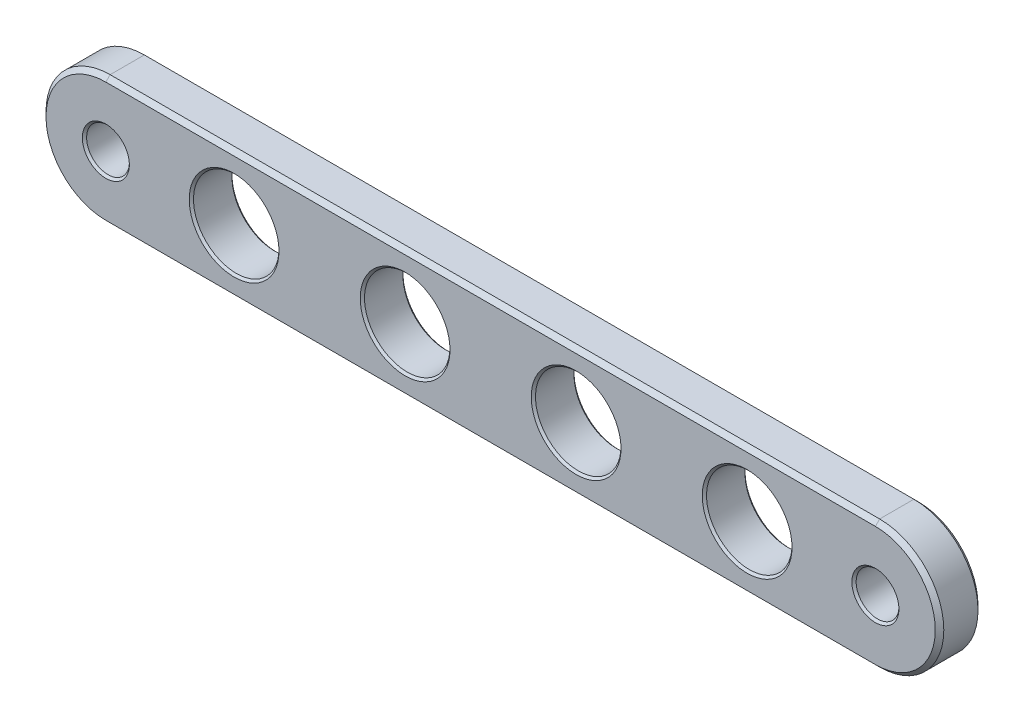
ISO-10303-21;
HEADER;
FILE_DESCRIPTION(('STEP AP214'),'2;1');
FILE_NAME('part.step','',(''),(''),'','','');
FILE_SCHEMA(('AUTOMOTIVE_DESIGN { 1 0 10303 214 1 1 1 1 }'));
ENDSEC;
DATA;
#1=APPLICATION_CONTEXT('core data for automotive mechanical design processes');
#2=APPLICATION_PROTOCOL_DEFINITION('international standard','automotive_design',2000,#1);
#3=PRODUCT_CONTEXT('',#1,'mechanical');
#4=PRODUCT('Part','Part','',(#3));
#5=PRODUCT_RELATED_PRODUCT_CATEGORY('part','',(#4));
#6=PRODUCT_DEFINITION_FORMATION('','',#4);
#7=PRODUCT_DEFINITION_CONTEXT('part definition',#1,'design');
#8=PRODUCT_DEFINITION('design','',#6,#7);
#9=PRODUCT_DEFINITION_SHAPE('','',#8);
#10=(LENGTH_UNIT() NAMED_UNIT(*) SI_UNIT(.MILLI.,.METRE.));
#11=(NAMED_UNIT(*) PLANE_ANGLE_UNIT() SI_UNIT($,.RADIAN.));
#12=(NAMED_UNIT(*) SI_UNIT($,.STERADIAN.) SOLID_ANGLE_UNIT());
#13=UNCERTAINTY_MEASURE_WITH_UNIT(LENGTH_MEASURE(1.E-05),#10,'distance_accuracy_value','');
#14=(GEOMETRIC_REPRESENTATION_CONTEXT(3) GLOBAL_UNCERTAINTY_ASSIGNED_CONTEXT((#13)) GLOBAL_UNIT_ASSIGNED_CONTEXT((#10,
#11,#12)) REPRESENTATION_CONTEXT('',''));
#15=CARTESIAN_POINT('',(0.,0.,0.));
#16=DIRECTION('',(0.,0.,1.));
#17=DIRECTION('',(1.,0.,0.));
#18=AXIS2_PLACEMENT_3D('',#15,#16,#17);
#19=CARTESIAN_POINT('',(-18.,0.,2.));
#20=DIRECTION('',(0.,0.,-1.));
#21=DIRECTION('',(-1.,0.,0.));
#22=AXIS2_PLACEMENT_3D('',#19,#20,#21);
#23=CYLINDRICAL_SURFACE('',#22,3.);
#24=DIRECTION('',(0.,0.,-1.));
#25=VECTOR('',#24,1.);
#26=CARTESIAN_POINT('',(-18.,3.,2.));
#27=LINE('',#26,#25);
#28=CARTESIAN_POINT('',(-18.,3.,1.8));
#29=VERTEX_POINT('',#28);
#30=CARTESIAN_POINT('',(-18.,3.,0.199999999999999));
#31=VERTEX_POINT('',#30);
#32=EDGE_CURVE('E133',#29,#31,#27,.T.);
#33=ORIENTED_EDGE('',*,*,#32,.T.);
#34=CARTESIAN_POINT('',(-18.,0.,0.199999999999999));
#35=DIRECTION('',(0.,0.,1.));
#36=DIRECTION('',(1.,0.,0.));
#37=AXIS2_PLACEMENT_3D('',#34,#35,#36);
#38=CIRCLE('',#37,3.);
#39=CARTESIAN_POINT('',(-18.,-3.,0.199999999999999));
#40=VERTEX_POINT('',#39);
#41=EDGE_CURVE('E140',#31,#40,#38,.T.);
#42=ORIENTED_EDGE('',*,*,#41,.T.);
#43=DIRECTION('',(0.,0.,-1.));
#44=VECTOR('',#43,1.);
#45=CARTESIAN_POINT('',(-18.,-3.,2.));
#46=LINE('',#45,#44);
#47=CARTESIAN_POINT('',(-18.,-3.,1.8));
#48=VERTEX_POINT('',#47);
#49=EDGE_CURVE('E135',#48,#40,#46,.T.);
#50=ORIENTED_EDGE('',*,*,#49,.F.);
#51=CARTESIAN_POINT('',(-18.,0.,1.8));
#52=DIRECTION('',(0.,0.,1.));
#53=DIRECTION('',(1.,0.,0.));
#54=AXIS2_PLACEMENT_3D('',#51,#52,#53);
#55=CIRCLE('',#54,3.);
#56=EDGE_CURVE('E131',#48,#29,#55,.F.);
#57=ORIENTED_EDGE('',*,*,#56,.T.);
#58=EDGE_LOOP('',(#33,#42,#50,#57));
#59=FACE_BOUND('',#58,.T.);
#60=ADVANCED_FACE('F60',(#59),#23,.T.);
#61=CARTESIAN_POINT('',(-18.,-3.,2.));
#62=DIRECTION('',(0.,1.,0.));
#63=DIRECTION('',(-1.,0.,0.));
#64=AXIS2_PLACEMENT_3D('',#61,#62,#63);
#65=PLANE('',#64);
#66=ORIENTED_EDGE('',*,*,#49,.T.);
#67=DIRECTION('',(1.,0.,0.));
#68=VECTOR('',#67,1.);
#69=CARTESIAN_POINT('',(-18.,-3.,0.199999999999999));
#70=LINE('',#69,#68);
#71=CARTESIAN_POINT('',(18.,-2.99999999999999,0.199999999999999));
#72=VERTEX_POINT('',#71);
#73=EDGE_CURVE('E332',#40,#72,#70,.T.);
#74=ORIENTED_EDGE('',*,*,#73,.T.);
#75=DIRECTION('',(0.,0.,-1.));
#76=VECTOR('',#75,1.);
#77=CARTESIAN_POINT('',(18.,-2.99999999999999,2.));
#78=LINE('',#77,#76);
#79=CARTESIAN_POINT('',(18.,-2.99999999999999,1.8));
#80=VERTEX_POINT('',#79);
#81=EDGE_CURVE('E861',#80,#72,#78,.T.);
#82=ORIENTED_EDGE('',*,*,#81,.F.);
#83=DIRECTION('',(-1.,0.,0.));
#84=VECTOR('',#83,1.);
#85=CARTESIAN_POINT('',(-18.,-3.,1.8));
#86=LINE('',#85,#84);
#87=EDGE_CURVE('E348',#80,#48,#86,.T.);
#88=ORIENTED_EDGE('',*,*,#87,.T.);
#89=EDGE_LOOP('',(#66,#74,#82,#88));
#90=FACE_BOUND('',#89,.T.);
#91=ADVANCED_FACE('F373',(#90),#65,.F.);
#92=CARTESIAN_POINT('',(18.,0.,2.));
#93=DIRECTION('',(0.,0.,-1.));
#94=DIRECTION('',(-1.,0.,0.));
#95=AXIS2_PLACEMENT_3D('',#92,#93,#94);
#96=CYLINDRICAL_SURFACE('',#95,3.);
#97=ORIENTED_EDGE('',*,*,#81,.T.);
#98=CARTESIAN_POINT('',(18.,0.,0.199999999999999));
#99=DIRECTION('',(0.,0.,1.));
#100=DIRECTION('',(1.,0.,0.));
#101=AXIS2_PLACEMENT_3D('',#98,#99,#100);
#102=CIRCLE('',#101,3.);
#103=CARTESIAN_POINT('',(18.,3.00000000000001,0.199999999999999));
#104=VERTEX_POINT('',#103);
#105=EDGE_CURVE('E329',#72,#104,#102,.T.);
#106=ORIENTED_EDGE('',*,*,#105,.T.);
#107=DIRECTION('',(0.,0.,-1.));
#108=VECTOR('',#107,1.);
#109=CARTESIAN_POINT('',(18.,3.00000000000001,2.));
#110=LINE('',#109,#108);
#111=CARTESIAN_POINT('',(18.,3.00000000000001,1.8));
#112=VERTEX_POINT('',#111);
#113=EDGE_CURVE('E153',#112,#104,#110,.T.);
#114=ORIENTED_EDGE('',*,*,#113,.F.);
#115=CARTESIAN_POINT('',(18.,0.,1.8));
#116=DIRECTION('',(0.,0.,1.));
#117=DIRECTION('',(1.,0.,0.));
#118=AXIS2_PLACEMENT_3D('',#115,#116,#117);
#119=CIRCLE('',#118,3.);
#120=EDGE_CURVE('E343',#112,#80,#119,.F.);
#121=ORIENTED_EDGE('',*,*,#120,.T.);
#122=EDGE_LOOP('',(#97,#106,#114,#121));
#123=FACE_BOUND('',#122,.T.);
#124=ADVANCED_FACE('F368',(#123),#96,.T.);
#125=CARTESIAN_POINT('',(-18.,3.,2.));
#126=DIRECTION('',(0.,-1.,0.));
#127=DIRECTION('',(1.,0.,0.));
#128=AXIS2_PLACEMENT_3D('',#125,#126,#127);
#129=PLANE('',#128);
#130=ORIENTED_EDGE('',*,*,#113,.T.);
#131=DIRECTION('',(-1.,0.,0.));
#132=VECTOR('',#131,1.);
#133=CARTESIAN_POINT('',(-18.,3.,0.199999999999999));
#134=LINE('',#133,#132);
#135=EDGE_CURVE('E151',#104,#31,#134,.T.);
#136=ORIENTED_EDGE('',*,*,#135,.T.);
#137=ORIENTED_EDGE('',*,*,#32,.F.);
#138=DIRECTION('',(1.,0.,0.));
#139=VECTOR('',#138,1.);
#140=CARTESIAN_POINT('',(18.,3.00000000000001,1.8));
#141=LINE('',#140,#139);
#142=EDGE_CURVE('E148',#29,#112,#141,.T.);
#143=ORIENTED_EDGE('',*,*,#142,.T.);
#144=EDGE_LOOP('',(#130,#136,#137,#143));
#145=FACE_BOUND('',#144,.T.);
#146=ADVANCED_FACE('F147',(#145),#129,.F.);
#147=CARTESIAN_POINT('',(-18.,0.,2.));
#148=DIRECTION('',(0.,0.,1.));
#149=DIRECTION('',(1.,0.,0.));
#150=AXIS2_PLACEMENT_3D('',#147,#148,#149);
#151=PLANE('',#150);
#152=CARTESIAN_POINT('',(18.,0.,2.));
#153=DIRECTION('',(0.,0.,1.));
#154=DIRECTION('',(1.,0.,0.));
#155=AXIS2_PLACEMENT_3D('',#152,#153,#154);
#156=CIRCLE('',#155,1.1);
#157=CARTESIAN_POINT('',(19.1,0.,2.));
#158=VERTEX_POINT('',#157);
#159=EDGE_CURVE('E204',#158,#158,#156,.F.);
#160=ORIENTED_EDGE('',*,*,#159,.T.);
#161=EDGE_LOOP('',(#160));
#162=FACE_BOUND('',#161,.T.);
#163=CARTESIAN_POINT('',(12.,0.,2.));
#164=DIRECTION('',(0.,0.,1.));
#165=DIRECTION('',(1.,0.,0.));
#166=AXIS2_PLACEMENT_3D('',#163,#164,#165);
#167=CIRCLE('',#166,2.1);
#168=CARTESIAN_POINT('',(14.1,0.,2.));
#169=VERTEX_POINT('',#168);
#170=EDGE_CURVE('E200',#169,#169,#167,.F.);
#171=ORIENTED_EDGE('',*,*,#170,.T.);
#172=EDGE_LOOP('',(#171));
#173=FACE_BOUND('',#172,.T.);
#174=CARTESIAN_POINT('',(4.,0.,2.));
#175=DIRECTION('',(0.,0.,1.));
#176=DIRECTION('',(1.,0.,0.));
#177=AXIS2_PLACEMENT_3D('',#174,#175,#176);
#178=CIRCLE('',#177,2.1);
#179=CARTESIAN_POINT('',(6.1,0.,2.));
#180=VERTEX_POINT('',#179);
#181=EDGE_CURVE('E196',#180,#180,#178,.F.);
#182=ORIENTED_EDGE('',*,*,#181,.T.);
#183=EDGE_LOOP('',(#182));
#184=FACE_BOUND('',#183,.T.);
#185=CARTESIAN_POINT('',(-4.,0.,2.));
#186=DIRECTION('',(0.,0.,1.));
#187=DIRECTION('',(1.,0.,0.));
#188=AXIS2_PLACEMENT_3D('',#185,#186,#187);
#189=CIRCLE('',#188,2.1);
#190=CARTESIAN_POINT('',(-1.89999999999999,0.,2.));
#191=VERTEX_POINT('',#190);
#192=EDGE_CURVE('E192',#191,#191,#189,.F.);
#193=ORIENTED_EDGE('',*,*,#192,.T.);
#194=EDGE_LOOP('',(#193));
#195=FACE_BOUND('',#194,.T.);
#196=CARTESIAN_POINT('',(-12.,0.,2.));
#197=DIRECTION('',(0.,0.,1.));
#198=DIRECTION('',(1.,0.,0.));
#199=AXIS2_PLACEMENT_3D('',#196,#197,#198);
#200=CIRCLE('',#199,2.1);
#201=CARTESIAN_POINT('',(-9.89999999999999,0.,2.));
#202=VERTEX_POINT('',#201);
#203=EDGE_CURVE('E188',#202,#202,#200,.F.);
#204=ORIENTED_EDGE('',*,*,#203,.T.);
#205=EDGE_LOOP('',(#204));
#206=FACE_BOUND('',#205,.T.);
#207=CARTESIAN_POINT('',(-18.,0.,2.));
#208=DIRECTION('',(0.,0.,1.));
#209=DIRECTION('',(1.,0.,0.));
#210=AXIS2_PLACEMENT_3D('',#207,#208,#209);
#211=CIRCLE('',#210,1.1);
#212=CARTESIAN_POINT('',(-16.9,0.,2.));
#213=VERTEX_POINT('',#212);
#214=EDGE_CURVE('E183',#213,#213,#211,.F.);
#215=ORIENTED_EDGE('',*,*,#214,.T.);
#216=EDGE_LOOP('',(#215));
#217=FACE_BOUND('',#216,.T.);
#218=CARTESIAN_POINT('',(18.,0.,2.));
#219=DIRECTION('',(0.,0.,1.));
#220=DIRECTION('',(1.,0.,0.));
#221=AXIS2_PLACEMENT_3D('',#218,#219,#220);
#222=CIRCLE('',#221,2.8);
#223=CARTESIAN_POINT('',(18.,-2.8,2.));
#224=VERTEX_POINT('',#223);
#225=CARTESIAN_POINT('',(18.,2.80000000000001,2.));
#226=VERTEX_POINT('',#225);
#227=EDGE_CURVE('E85',#224,#226,#222,.T.);
#228=ORIENTED_EDGE('',*,*,#227,.T.);
#229=DIRECTION('',(-1.,0.,0.));
#230=VECTOR('',#229,1.);
#231=CARTESIAN_POINT('',(-18.,2.8,2.));
#232=LINE('',#231,#230);
#233=CARTESIAN_POINT('',(-18.,2.8,2.));
#234=VERTEX_POINT('',#233);
#235=EDGE_CURVE('E184',#226,#234,#232,.T.);
#236=ORIENTED_EDGE('',*,*,#235,.T.);
#237=CARTESIAN_POINT('',(-18.,0.,2.));
#238=DIRECTION('',(0.,0.,1.));
#239=DIRECTION('',(1.,0.,0.));
#240=AXIS2_PLACEMENT_3D('',#237,#238,#239);
#241=CIRCLE('',#240,2.8);
#242=CARTESIAN_POINT('',(-18.,-2.8,2.));
#243=VERTEX_POINT('',#242);
#244=EDGE_CURVE('E162',#234,#243,#241,.T.);
#245=ORIENTED_EDGE('',*,*,#244,.T.);
#246=DIRECTION('',(1.,0.,0.));
#247=VECTOR('',#246,1.);
#248=CARTESIAN_POINT('',(18.,-2.8,2.));
#249=LINE('',#248,#247);
#250=EDGE_CURVE('E353',#243,#224,#249,.T.);
#251=ORIENTED_EDGE('',*,*,#250,.T.);
#252=EDGE_LOOP('',(#228,#236,#245,#251));
#253=FACE_BOUND('',#252,.T.);
#254=ADVANCED_FACE('F285',(#162,#173,#184,#195,#206,#217,#253),#151,.T.);
#255=CARTESIAN_POINT('',(-18.,0.,0.));
#256=DIRECTION('',(0.,0.,1.));
#257=DIRECTION('',(1.,0.,0.));
#258=AXIS2_PLACEMENT_3D('',#255,#256,#257);
#259=PLANE('',#258);
#260=CARTESIAN_POINT('',(18.,0.,0.));
#261=DIRECTION('',(0.,0.,1.));
#262=DIRECTION('',(1.,0.,0.));
#263=AXIS2_PLACEMENT_3D('',#260,#261,#262);
#264=CIRCLE('',#263,1.09999999999999);
#265=CARTESIAN_POINT('',(19.1,0.,0.));
#266=VERTEX_POINT('',#265);
#267=EDGE_CURVE('E248',#266,#266,#264,.T.);
#268=ORIENTED_EDGE('',*,*,#267,.T.);
#269=EDGE_LOOP('',(#268));
#270=FACE_BOUND('',#269,.T.);
#271=CARTESIAN_POINT('',(12.,0.,0.));
#272=DIRECTION('',(0.,0.,1.));
#273=DIRECTION('',(1.,0.,0.));
#274=AXIS2_PLACEMENT_3D('',#271,#272,#273);
#275=CIRCLE('',#274,2.1);
#276=CARTESIAN_POINT('',(14.1,0.,0.));
#277=VERTEX_POINT('',#276);
#278=EDGE_CURVE('E244',#277,#277,#275,.T.);
#279=ORIENTED_EDGE('',*,*,#278,.T.);
#280=EDGE_LOOP('',(#279));
#281=FACE_BOUND('',#280,.T.);
#282=CARTESIAN_POINT('',(4.,0.,0.));
#283=DIRECTION('',(0.,0.,1.));
#284=DIRECTION('',(1.,0.,0.));
#285=AXIS2_PLACEMENT_3D('',#282,#283,#284);
#286=CIRCLE('',#285,2.1);
#287=CARTESIAN_POINT('',(6.1,0.,0.));
#288=VERTEX_POINT('',#287);
#289=EDGE_CURVE('E240',#288,#288,#286,.T.);
#290=ORIENTED_EDGE('',*,*,#289,.T.);
#291=EDGE_LOOP('',(#290));
#292=FACE_BOUND('',#291,.T.);
#293=CARTESIAN_POINT('',(-4.,0.,0.));
#294=DIRECTION('',(0.,0.,1.));
#295=DIRECTION('',(1.,0.,0.));
#296=AXIS2_PLACEMENT_3D('',#293,#294,#295);
#297=CIRCLE('',#296,2.1);
#298=CARTESIAN_POINT('',(-1.89999999999999,0.,0.));
#299=VERTEX_POINT('',#298);
#300=EDGE_CURVE('E236',#299,#299,#297,.T.);
#301=ORIENTED_EDGE('',*,*,#300,.T.);
#302=EDGE_LOOP('',(#301));
#303=FACE_BOUND('',#302,.T.);
#304=CARTESIAN_POINT('',(-12.,0.,0.));
#305=DIRECTION('',(0.,0.,1.));
#306=DIRECTION('',(1.,0.,0.));
#307=AXIS2_PLACEMENT_3D('',#304,#305,#306);
#308=CIRCLE('',#307,2.1);
#309=CARTESIAN_POINT('',(-9.89999999999999,0.,0.));
#310=VERTEX_POINT('',#309);
#311=EDGE_CURVE('E232',#310,#310,#308,.T.);
#312=ORIENTED_EDGE('',*,*,#311,.T.);
#313=EDGE_LOOP('',(#312));
#314=FACE_BOUND('',#313,.T.);
#315=CARTESIAN_POINT('',(-18.,0.,0.));
#316=DIRECTION('',(0.,0.,1.));
#317=DIRECTION('',(1.,0.,0.));
#318=AXIS2_PLACEMENT_3D('',#315,#316,#317);
#319=CIRCLE('',#318,1.09999999999999);
#320=CARTESIAN_POINT('',(-16.9,0.,0.));
#321=VERTEX_POINT('',#320);
#322=EDGE_CURVE('E228',#321,#321,#319,.T.);
#323=ORIENTED_EDGE('',*,*,#322,.T.);
#324=EDGE_LOOP('',(#323));
#325=FACE_BOUND('',#324,.T.);
#326=CARTESIAN_POINT('',(-18.,0.,0.));
#327=DIRECTION('',(0.,0.,1.));
#328=DIRECTION('',(1.,0.,0.));
#329=AXIS2_PLACEMENT_3D('',#326,#327,#328);
#330=CIRCLE('',#329,2.8);
#331=CARTESIAN_POINT('',(-18.,-2.8,0.));
#332=VERTEX_POINT('',#331);
#333=CARTESIAN_POINT('',(-18.,2.8,0.));
#334=VERTEX_POINT('',#333);
#335=EDGE_CURVE('E292',#332,#334,#330,.F.);
#336=ORIENTED_EDGE('',*,*,#335,.T.);
#337=DIRECTION('',(1.,0.,0.));
#338=VECTOR('',#337,1.);
#339=CARTESIAN_POINT('',(-18.,2.8,0.));
#340=LINE('',#339,#338);
#341=CARTESIAN_POINT('',(18.,2.8,0.));
#342=VERTEX_POINT('',#341);
#343=EDGE_CURVE('E141',#334,#342,#340,.T.);
#344=ORIENTED_EDGE('',*,*,#343,.T.);
#345=CARTESIAN_POINT('',(18.,0.,0.));
#346=DIRECTION('',(0.,0.,1.));
#347=DIRECTION('',(1.,0.,0.));
#348=AXIS2_PLACEMENT_3D('',#345,#346,#347);
#349=CIRCLE('',#348,2.8);
#350=CARTESIAN_POINT('',(18.,-2.79999999999999,0.));
#351=VERTEX_POINT('',#350);
#352=EDGE_CURVE('E301',#342,#351,#349,.F.);
#353=ORIENTED_EDGE('',*,*,#352,.T.);
#354=DIRECTION('',(-1.,0.,0.));
#355=VECTOR('',#354,1.);
#356=CARTESIAN_POINT('',(-18.,-2.8,0.));
#357=LINE('',#356,#355);
#358=EDGE_CURVE('E295',#351,#332,#357,.T.);
#359=ORIENTED_EDGE('',*,*,#358,.T.);
#360=EDGE_LOOP('',(#336,#344,#353,#359));
#361=FACE_BOUND('',#360,.T.);
#362=ADVANCED_FACE('F281',(#270,#281,#292,#303,#314,#325,#361),#259,.F.);
#363=CARTESIAN_POINT('',(-18.,-3.,0.199999999999999));
#364=DIRECTION('',(0.,0.707106781186541,0.707106781186554));
#365=DIRECTION('',(1.,0.,0.));
#366=AXIS2_PLACEMENT_3D('',#363,#364,#365);
#367=PLANE('',#366);
#368=DIRECTION('',(0.,-0.707106781186554,0.707106781186541));
#369=VECTOR('',#368,1.);
#370=CARTESIAN_POINT('',(-18.,-2.8,0.));
#371=LINE('',#370,#369);
#372=EDGE_CURVE('E316',#332,#40,#371,.T.);
#373=ORIENTED_EDGE('',*,*,#372,.F.);
#374=ORIENTED_EDGE('',*,*,#358,.F.);
#375=DIRECTION('',(0.,0.707106781186554,-0.707106781186541));
#376=VECTOR('',#375,1.);
#377=CARTESIAN_POINT('',(18.,-2.99999999999999,0.199999999999999));
#378=LINE('',#377,#376);
#379=EDGE_CURVE('E154',#72,#351,#378,.T.);
#380=ORIENTED_EDGE('',*,*,#379,.F.);
#381=ORIENTED_EDGE('',*,*,#73,.F.);
#382=EDGE_LOOP('',(#373,#374,#380,#381));
#383=FACE_BOUND('',#382,.T.);
#384=ADVANCED_FACE('F284',(#383),#367,.F.);
#385=CARTESIAN_POINT('',(18.,0.,0.199999999999999));
#386=DIRECTION('',(0.,0.,1.));
#387=DIRECTION('',(1.,0.,0.));
#388=AXIS2_PLACEMENT_3D('',#385,#386,#387);
#389=CONICAL_SURFACE('',#388,3.,0.785398163397457);
#390=ORIENTED_EDGE('',*,*,#379,.T.);
#391=ORIENTED_EDGE('',*,*,#352,.F.);
#392=DIRECTION('',(0.,-0.707106781186554,-0.707106781186541));
#393=VECTOR('',#392,1.);
#394=CARTESIAN_POINT('',(18.,3.00000000000001,0.199999999999999));
#395=LINE('',#394,#393);
#396=EDGE_CURVE('E307',#104,#342,#395,.T.);
#397=ORIENTED_EDGE('',*,*,#396,.F.);
#398=ORIENTED_EDGE('',*,*,#105,.F.);
#399=EDGE_LOOP('',(#390,#391,#397,#398));
#400=FACE_BOUND('',#399,.T.);
#401=ADVANCED_FACE('F328',(#400),#389,.T.);
#402=CARTESIAN_POINT('',(-18.,0.,0.199999999999999));
#403=DIRECTION('',(0.,0.,1.));
#404=DIRECTION('',(1.,0.,0.));
#405=AXIS2_PLACEMENT_3D('',#402,#403,#404);
#406=CONICAL_SURFACE('',#405,3.,0.785398163397457);
#407=ORIENTED_EDGE('',*,*,#372,.T.);
#408=ORIENTED_EDGE('',*,*,#41,.F.);
#409=DIRECTION('',(0.,0.707106781186554,0.707106781186541));
#410=VECTOR('',#409,1.);
#411=CARTESIAN_POINT('',(-18.,2.8,0.));
#412=LINE('',#411,#410);
#413=EDGE_CURVE('E178',#334,#31,#412,.T.);
#414=ORIENTED_EDGE('',*,*,#413,.F.);
#415=ORIENTED_EDGE('',*,*,#335,.F.);
#416=EDGE_LOOP('',(#407,#408,#414,#415));
#417=FACE_BOUND('',#416,.T.);
#418=ADVANCED_FACE('F311',(#417),#406,.T.);
#419=CARTESIAN_POINT('',(-18.,3.,0.199999999999999));
#420=DIRECTION('',(0.,-0.707106781186541,0.707106781186554));
#421=DIRECTION('',(-1.,0.,0.));
#422=AXIS2_PLACEMENT_3D('',#419,#420,#421);
#423=PLANE('',#422);
#424=ORIENTED_EDGE('',*,*,#396,.T.);
#425=ORIENTED_EDGE('',*,*,#343,.F.);
#426=ORIENTED_EDGE('',*,*,#413,.T.);
#427=ORIENTED_EDGE('',*,*,#135,.F.);
#428=EDGE_LOOP('',(#424,#425,#426,#427));
#429=FACE_BOUND('',#428,.T.);
#430=ADVANCED_FACE('F304',(#429),#423,.F.);
#431=CARTESIAN_POINT('',(-18.,-2.8,2.));
#432=DIRECTION('',(0.,-0.707106781186547,0.707106781186547));
#433=DIRECTION('',(-1.,0.,0.));
#434=AXIS2_PLACEMENT_3D('',#431,#432,#433);
#435=PLANE('',#434);
#436=DIRECTION('',(0.,0.707106781186547,0.707106781186547));
#437=VECTOR('',#436,1.);
#438=CARTESIAN_POINT('',(-18.,-3.,1.8));
#439=LINE('',#438,#437);
#440=EDGE_CURVE('E167',#48,#243,#439,.T.);
#441=ORIENTED_EDGE('',*,*,#440,.F.);
#442=ORIENTED_EDGE('',*,*,#87,.F.);
#443=DIRECTION('',(0.,-0.707106781186547,-0.707106781186547));
#444=VECTOR('',#443,1.);
#445=CARTESIAN_POINT('',(18.,-2.8,2.));
#446=LINE('',#445,#444);
#447=EDGE_CURVE('E174',#224,#80,#446,.T.);
#448=ORIENTED_EDGE('',*,*,#447,.F.);
#449=ORIENTED_EDGE('',*,*,#250,.F.);
#450=EDGE_LOOP('',(#441,#442,#448,#449));
#451=FACE_BOUND('',#450,.T.);
#452=ADVANCED_FACE('F389',(#451),#435,.T.);
#453=CARTESIAN_POINT('',(18.,0.,2.));
#454=DIRECTION('',(0.,0.,-1.));
#455=DIRECTION('',(-1.,0.,0.));
#456=AXIS2_PLACEMENT_3D('',#453,#454,#455);
#457=CONICAL_SURFACE('',#456,2.8,0.785398163397448);
#458=ORIENTED_EDGE('',*,*,#447,.T.);
#459=ORIENTED_EDGE('',*,*,#120,.F.);
#460=DIRECTION('',(0.,0.707106781186547,-0.707106781186547));
#461=VECTOR('',#460,1.);
#462=CARTESIAN_POINT('',(18.,2.80000000000001,2.));
#463=LINE('',#462,#461);
#464=EDGE_CURVE('E157',#226,#112,#463,.T.);
#465=ORIENTED_EDGE('',*,*,#464,.F.);
#466=ORIENTED_EDGE('',*,*,#227,.F.);
#467=EDGE_LOOP('',(#458,#459,#465,#466));
#468=FACE_BOUND('',#467,.T.);
#469=ADVANCED_FACE('F417',(#468),#457,.T.);
#470=CARTESIAN_POINT('',(-18.,0.,2.));
#471=DIRECTION('',(0.,0.,-1.));
#472=DIRECTION('',(-1.,0.,0.));
#473=AXIS2_PLACEMENT_3D('',#470,#471,#472);
#474=CONICAL_SURFACE('',#473,2.8,0.785398163397448);
#475=ORIENTED_EDGE('',*,*,#440,.T.);
#476=ORIENTED_EDGE('',*,*,#244,.F.);
#477=DIRECTION('',(0.,-0.707106781186547,0.707106781186547));
#478=VECTOR('',#477,1.);
#479=CARTESIAN_POINT('',(-18.,3.,1.8));
#480=LINE('',#479,#478);
#481=EDGE_CURVE('E77',#29,#234,#480,.T.);
#482=ORIENTED_EDGE('',*,*,#481,.F.);
#483=ORIENTED_EDGE('',*,*,#56,.F.);
#484=EDGE_LOOP('',(#475,#476,#482,#483));
#485=FACE_BOUND('',#484,.T.);
#486=ADVANCED_FACE('F161',(#485),#474,.T.);
#487=CARTESIAN_POINT('',(-18.,2.8,2.));
#488=DIRECTION('',(0.,0.707106781186547,0.707106781186547));
#489=DIRECTION('',(1.,0.,0.));
#490=AXIS2_PLACEMENT_3D('',#487,#488,#489);
#491=PLANE('',#490);
#492=ORIENTED_EDGE('',*,*,#464,.T.);
#493=ORIENTED_EDGE('',*,*,#142,.F.);
#494=ORIENTED_EDGE('',*,*,#481,.T.);
#495=ORIENTED_EDGE('',*,*,#235,.F.);
#496=EDGE_LOOP('',(#492,#493,#494,#495));
#497=FACE_BOUND('',#496,.T.);
#498=ADVANCED_FACE('F156',(#497),#491,.T.);
#499=CARTESIAN_POINT('',(18.,0.,0.));
#500=DIRECTION('',(0.,0.,1.));
#501=DIRECTION('',(1.,0.,0.));
#502=AXIS2_PLACEMENT_3D('',#499,#500,#501);
#503=CYLINDRICAL_SURFACE('',#502,1.);
#504=CARTESIAN_POINT('',(18.,0.,0.0999999999999918));
#505=DIRECTION('',(0.,0.,1.));
#506=DIRECTION('',(1.,0.,0.));
#507=AXIS2_PLACEMENT_3D('',#504,#505,#506);
#508=CIRCLE('',#507,1.);
#509=CARTESIAN_POINT('',(19.,0.,0.0999999999999918));
#510=VERTEX_POINT('',#509);
#511=EDGE_CURVE('E252',#510,#510,#508,.F.);
#512=ORIENTED_EDGE('',*,*,#511,.T.);
#513=EDGE_LOOP('',(#512));
#514=FACE_BOUND('',#513,.T.);
#515=CARTESIAN_POINT('',(18.,0.,1.90000000000001));
#516=DIRECTION('',(0.,0.,1.));
#517=DIRECTION('',(1.,0.,0.));
#518=AXIS2_PLACEMENT_3D('',#515,#516,#517);
#519=CIRCLE('',#518,1.);
#520=CARTESIAN_POINT('',(19.,0.,1.90000000000001));
#521=VERTEX_POINT('',#520);
#522=EDGE_CURVE('E179',#521,#521,#519,.T.);
#523=ORIENTED_EDGE('',*,*,#522,.T.);
#524=EDGE_LOOP('',(#523));
#525=FACE_BOUND('',#524,.T.);
#526=ADVANCED_FACE('F411',(#514,#525),#503,.F.);
#527=CARTESIAN_POINT('',(12.,0.,0.));
#528=DIRECTION('',(0.,0.,1.));
#529=DIRECTION('',(1.,0.,0.));
#530=AXIS2_PLACEMENT_3D('',#527,#528,#529);
#531=CYLINDRICAL_SURFACE('',#530,2.);
#532=CARTESIAN_POINT('',(12.,0.,0.100000000000005));
#533=DIRECTION('',(0.,0.,1.));
#534=DIRECTION('',(1.,0.,0.));
#535=AXIS2_PLACEMENT_3D('',#532,#533,#534);
#536=CIRCLE('',#535,2.);
#537=CARTESIAN_POINT('',(14.,0.,0.100000000000005));
#538=VERTEX_POINT('',#537);
#539=EDGE_CURVE('E256',#538,#538,#536,.F.);
#540=ORIENTED_EDGE('',*,*,#539,.T.);
#541=EDGE_LOOP('',(#540));
#542=FACE_BOUND('',#541,.T.);
#543=CARTESIAN_POINT('',(12.,0.,1.9));
#544=DIRECTION('',(0.,0.,1.));
#545=DIRECTION('',(1.,0.,0.));
#546=AXIS2_PLACEMENT_3D('',#543,#544,#545);
#547=CIRCLE('',#546,2.);
#548=CARTESIAN_POINT('',(14.,0.,1.9));
#549=VERTEX_POINT('',#548);
#550=EDGE_CURVE('E208',#549,#549,#547,.T.);
#551=ORIENTED_EDGE('',*,*,#550,.T.);
#552=EDGE_LOOP('',(#551));
#553=FACE_BOUND('',#552,.T.);
#554=ADVANCED_FACE('F525',(#542,#553),#531,.F.);
#555=CARTESIAN_POINT('',(4.,0.,0.));
#556=DIRECTION('',(0.,0.,1.));
#557=DIRECTION('',(1.,0.,0.));
#558=AXIS2_PLACEMENT_3D('',#555,#556,#557);
#559=CYLINDRICAL_SURFACE('',#558,2.);
#560=CARTESIAN_POINT('',(4.,0.,0.100000000000005));
#561=DIRECTION('',(0.,0.,1.));
#562=DIRECTION('',(1.,0.,0.));
#563=AXIS2_PLACEMENT_3D('',#560,#561,#562);
#564=CIRCLE('',#563,2.);
#565=CARTESIAN_POINT('',(6.,0.,0.100000000000005));
#566=VERTEX_POINT('',#565);
#567=EDGE_CURVE('E260',#566,#566,#564,.F.);
#568=ORIENTED_EDGE('',*,*,#567,.T.);
#569=EDGE_LOOP('',(#568));
#570=FACE_BOUND('',#569,.T.);
#571=CARTESIAN_POINT('',(4.,0.,1.9));
#572=DIRECTION('',(0.,0.,1.));
#573=DIRECTION('',(1.,0.,0.));
#574=AXIS2_PLACEMENT_3D('',#571,#572,#573);
#575=CIRCLE('',#574,2.);
#576=CARTESIAN_POINT('',(6.,0.,1.9));
#577=VERTEX_POINT('',#576);
#578=EDGE_CURVE('E212',#577,#577,#575,.T.);
#579=ORIENTED_EDGE('',*,*,#578,.T.);
#580=EDGE_LOOP('',(#579));
#581=FACE_BOUND('',#580,.T.);
#582=ADVANCED_FACE('F520',(#570,#581),#559,.F.);
#583=CARTESIAN_POINT('',(-12.,0.,0.));
#584=DIRECTION('',(0.,0.,1.));
#585=DIRECTION('',(1.,0.,0.));
#586=AXIS2_PLACEMENT_3D('',#583,#584,#585);
#587=CYLINDRICAL_SURFACE('',#586,2.);
#588=CARTESIAN_POINT('',(-12.,0.,0.100000000000005));
#589=DIRECTION('',(0.,0.,1.));
#590=DIRECTION('',(1.,0.,0.));
#591=AXIS2_PLACEMENT_3D('',#588,#589,#590);
#592=CIRCLE('',#591,2.);
#593=CARTESIAN_POINT('',(-10.,0.,0.100000000000005));
#594=VERTEX_POINT('',#593);
#595=EDGE_CURVE('E70',#594,#594,#592,.F.);
#596=ORIENTED_EDGE('',*,*,#595,.T.);
#597=EDGE_LOOP('',(#596));
#598=FACE_BOUND('',#597,.T.);
#599=CARTESIAN_POINT('',(-12.,0.,1.9));
#600=DIRECTION('',(0.,0.,1.));
#601=DIRECTION('',(1.,0.,0.));
#602=AXIS2_PLACEMENT_3D('',#599,#600,#601);
#603=CIRCLE('',#602,2.);
#604=CARTESIAN_POINT('',(-10.,0.,1.9));
#605=VERTEX_POINT('',#604);
#606=EDGE_CURVE('E220',#605,#605,#603,.T.);
#607=ORIENTED_EDGE('',*,*,#606,.T.);
#608=EDGE_LOOP('',(#607));
#609=FACE_BOUND('',#608,.T.);
#610=ADVANCED_FACE('F272',(#598,#609),#587,.F.);
#611=CARTESIAN_POINT('',(-4.,0.,0.));
#612=DIRECTION('',(0.,0.,1.));
#613=DIRECTION('',(1.,0.,0.));
#614=AXIS2_PLACEMENT_3D('',#611,#612,#613);
#615=CYLINDRICAL_SURFACE('',#614,2.);
#616=CARTESIAN_POINT('',(-4.,0.,0.100000000000005));
#617=DIRECTION('',(0.,0.,1.));
#618=DIRECTION('',(1.,0.,0.));
#619=AXIS2_PLACEMENT_3D('',#616,#617,#618);
#620=CIRCLE('',#619,2.);
#621=CARTESIAN_POINT('',(-2.,0.,0.100000000000005));
#622=VERTEX_POINT('',#621);
#623=EDGE_CURVE('E264',#622,#622,#620,.F.);
#624=ORIENTED_EDGE('',*,*,#623,.T.);
#625=EDGE_LOOP('',(#624));
#626=FACE_BOUND('',#625,.T.);
#627=CARTESIAN_POINT('',(-4.,0.,1.9));
#628=DIRECTION('',(0.,0.,1.));
#629=DIRECTION('',(1.,0.,0.));
#630=AXIS2_PLACEMENT_3D('',#627,#628,#629);
#631=CIRCLE('',#630,2.);
#632=CARTESIAN_POINT('',(-2.,0.,1.9));
#633=VERTEX_POINT('',#632);
#634=EDGE_CURVE('E216',#633,#633,#631,.T.);
#635=ORIENTED_EDGE('',*,*,#634,.T.);
#636=EDGE_LOOP('',(#635));
#637=FACE_BOUND('',#636,.T.);
#638=ADVANCED_FACE('F508',(#626,#637),#615,.F.);
#639=CARTESIAN_POINT('',(-18.,0.,0.));
#640=DIRECTION('',(0.,0.,1.));
#641=DIRECTION('',(1.,0.,0.));
#642=AXIS2_PLACEMENT_3D('',#639,#640,#641);
#643=CYLINDRICAL_SURFACE('',#642,1.);
#644=CARTESIAN_POINT('',(-18.,0.,0.0999999999999918));
#645=DIRECTION('',(0.,0.,1.));
#646=DIRECTION('',(1.,0.,0.));
#647=AXIS2_PLACEMENT_3D('',#644,#645,#646);
#648=CIRCLE('',#647,1.);
#649=CARTESIAN_POINT('',(-17.,0.,0.0999999999999918));
#650=VERTEX_POINT('',#649);
#651=EDGE_CURVE('E13',#650,#650,#648,.F.);
#652=ORIENTED_EDGE('',*,*,#651,.T.);
#653=EDGE_LOOP('',(#652));
#654=FACE_BOUND('',#653,.T.);
#655=CARTESIAN_POINT('',(-18.,0.,1.90000000000001));
#656=DIRECTION('',(0.,0.,1.));
#657=DIRECTION('',(1.,0.,0.));
#658=AXIS2_PLACEMENT_3D('',#655,#656,#657);
#659=CIRCLE('',#658,1.);
#660=CARTESIAN_POINT('',(-17.,0.,1.90000000000001));
#661=VERTEX_POINT('',#660);
#662=EDGE_CURVE('E224',#661,#661,#659,.T.);
#663=ORIENTED_EDGE('',*,*,#662,.T.);
#664=EDGE_LOOP('',(#663));
#665=FACE_BOUND('',#664,.T.);
#666=ADVANCED_FACE('F435',(#654,#665),#643,.F.);
#667=CARTESIAN_POINT('',(18.,0.,1.90000000000001));
#668=DIRECTION('',(0.,0.,1.));
#669=DIRECTION('',(1.,0.,0.));
#670=AXIS2_PLACEMENT_3D('',#667,#668,#669);
#671=CONICAL_SURFACE('',#670,1.,0.785398163397456);
#672=ORIENTED_EDGE('',*,*,#159,.F.);
#673=EDGE_LOOP('',(#672));
#674=FACE_BOUND('',#673,.T.);
#675=ORIENTED_EDGE('',*,*,#522,.F.);
#676=EDGE_LOOP('',(#675));
#677=FACE_BOUND('',#676,.T.);
#678=ADVANCED_FACE('F428',(#674,#677),#671,.F.);
#679=CARTESIAN_POINT('',(12.,0.,1.9));
#680=DIRECTION('',(0.,0.,1.));
#681=DIRECTION('',(1.,0.,0.));
#682=AXIS2_PLACEMENT_3D('',#679,#680,#681);
#683=CONICAL_SURFACE('',#682,2.,0.785398163397463);
#684=ORIENTED_EDGE('',*,*,#170,.F.);
#685=EDGE_LOOP('',(#684));
#686=FACE_BOUND('',#685,.T.);
#687=ORIENTED_EDGE('',*,*,#550,.F.);
#688=EDGE_LOOP('',(#687));
#689=FACE_BOUND('',#688,.T.);
#690=ADVANCED_FACE('F434',(#686,#689),#683,.F.);
#691=CARTESIAN_POINT('',(4.,0.,1.9));
#692=DIRECTION('',(0.,0.,1.));
#693=DIRECTION('',(1.,0.,0.));
#694=AXIS2_PLACEMENT_3D('',#691,#692,#693);
#695=CONICAL_SURFACE('',#694,2.,0.785398163397463);
#696=ORIENTED_EDGE('',*,*,#181,.F.);
#697=EDGE_LOOP('',(#696));
#698=FACE_BOUND('',#697,.T.);
#699=ORIENTED_EDGE('',*,*,#578,.F.);
#700=EDGE_LOOP('',(#699));
#701=FACE_BOUND('',#700,.T.);
#702=ADVANCED_FACE('F442',(#698,#701),#695,.F.);
#703=CARTESIAN_POINT('',(-4.,0.,1.9));
#704=DIRECTION('',(0.,0.,1.));
#705=DIRECTION('',(1.,0.,0.));
#706=AXIS2_PLACEMENT_3D('',#703,#704,#705);
#707=CONICAL_SURFACE('',#706,2.,0.785398163397463);
#708=ORIENTED_EDGE('',*,*,#192,.F.);
#709=EDGE_LOOP('',(#708));
#710=FACE_BOUND('',#709,.T.);
#711=ORIENTED_EDGE('',*,*,#634,.F.);
#712=EDGE_LOOP('',(#711));
#713=FACE_BOUND('',#712,.T.);
#714=ADVANCED_FACE('F449',(#710,#713),#707,.F.);
#715=CARTESIAN_POINT('',(-12.,0.,1.9));
#716=DIRECTION('',(0.,0.,1.));
#717=DIRECTION('',(1.,0.,0.));
#718=AXIS2_PLACEMENT_3D('',#715,#716,#717);
#719=CONICAL_SURFACE('',#718,2.,0.785398163397463);
#720=ORIENTED_EDGE('',*,*,#203,.F.);
#721=EDGE_LOOP('',(#720));
#722=FACE_BOUND('',#721,.T.);
#723=ORIENTED_EDGE('',*,*,#606,.F.);
#724=EDGE_LOOP('',(#723));
#725=FACE_BOUND('',#724,.T.);
#726=ADVANCED_FACE('F456',(#722,#725),#719,.F.);
#727=CARTESIAN_POINT('',(-18.,0.,1.90000000000001));
#728=DIRECTION('',(0.,0.,1.));
#729=DIRECTION('',(1.,0.,0.));
#730=AXIS2_PLACEMENT_3D('',#727,#728,#729);
#731=CONICAL_SURFACE('',#730,1.,0.785398163397456);
#732=ORIENTED_EDGE('',*,*,#214,.F.);
#733=EDGE_LOOP('',(#732));
#734=FACE_BOUND('',#733,.T.);
#735=ORIENTED_EDGE('',*,*,#662,.F.);
#736=EDGE_LOOP('',(#735));
#737=FACE_BOUND('',#736,.T.);
#738=ADVANCED_FACE('F463',(#734,#737),#731,.F.);
#739=CARTESIAN_POINT('',(18.,0.,0.));
#740=DIRECTION('',(0.,0.,-1.));
#741=DIRECTION('',(-1.,0.,0.));
#742=AXIS2_PLACEMENT_3D('',#739,#740,#741);
#743=CONICAL_SURFACE('',#742,1.09999999999999,0.785398163397448);
#744=ORIENTED_EDGE('',*,*,#511,.F.);
#745=EDGE_LOOP('',(#744));
#746=FACE_BOUND('',#745,.T.);
#747=ORIENTED_EDGE('',*,*,#267,.F.);
#748=EDGE_LOOP('',(#747));
#749=FACE_BOUND('',#748,.T.);
#750=ADVANCED_FACE('F470',(#746,#749),#743,.F.);
#751=CARTESIAN_POINT('',(12.,0.,0.));
#752=DIRECTION('',(0.,0.,-1.));
#753=DIRECTION('',(-1.,0.,0.));
#754=AXIS2_PLACEMENT_3D('',#751,#752,#753);
#755=CONICAL_SURFACE('',#754,2.1,0.785398163397448);
#756=ORIENTED_EDGE('',*,*,#539,.F.);
#757=EDGE_LOOP('',(#756));
#758=FACE_BOUND('',#757,.T.);
#759=ORIENTED_EDGE('',*,*,#278,.F.);
#760=EDGE_LOOP('',(#759));
#761=FACE_BOUND('',#760,.T.);
#762=ADVANCED_FACE('F477',(#758,#761),#755,.F.);
#763=CARTESIAN_POINT('',(4.,0.,0.));
#764=DIRECTION('',(0.,0.,-1.));
#765=DIRECTION('',(-1.,0.,0.));
#766=AXIS2_PLACEMENT_3D('',#763,#764,#765);
#767=CONICAL_SURFACE('',#766,2.1,0.785398163397448);
#768=ORIENTED_EDGE('',*,*,#567,.F.);
#769=EDGE_LOOP('',(#768));
#770=FACE_BOUND('',#769,.T.);
#771=ORIENTED_EDGE('',*,*,#289,.F.);
#772=EDGE_LOOP('',(#771));
#773=FACE_BOUND('',#772,.T.);
#774=ADVANCED_FACE('F484',(#770,#773),#767,.F.);
#775=CARTESIAN_POINT('',(-4.,0.,0.));
#776=DIRECTION('',(0.,0.,-1.));
#777=DIRECTION('',(-1.,0.,0.));
#778=AXIS2_PLACEMENT_3D('',#775,#776,#777);
#779=CONICAL_SURFACE('',#778,2.1,0.785398163397448);
#780=ORIENTED_EDGE('',*,*,#623,.F.);
#781=EDGE_LOOP('',(#780));
#782=FACE_BOUND('',#781,.T.);
#783=ORIENTED_EDGE('',*,*,#300,.F.);
#784=EDGE_LOOP('',(#783));
#785=FACE_BOUND('',#784,.T.);
#786=ADVANCED_FACE('F278',(#782,#785),#779,.F.);
#787=CARTESIAN_POINT('',(-12.,0.,0.));
#788=DIRECTION('',(0.,0.,-1.));
#789=DIRECTION('',(-1.,0.,0.));
#790=AXIS2_PLACEMENT_3D('',#787,#788,#789);
#791=CONICAL_SURFACE('',#790,2.1,0.785398163397448);
#792=ORIENTED_EDGE('',*,*,#595,.F.);
#793=EDGE_LOOP('',(#792));
#794=FACE_BOUND('',#793,.T.);
#795=ORIENTED_EDGE('',*,*,#311,.F.);
#796=EDGE_LOOP('',(#795));
#797=FACE_BOUND('',#796,.T.);
#798=ADVANCED_FACE('F275',(#794,#797),#791,.F.);
#799=CARTESIAN_POINT('',(-18.,0.,0.));
#800=DIRECTION('',(0.,0.,-1.));
#801=DIRECTION('',(-1.,0.,0.));
#802=AXIS2_PLACEMENT_3D('',#799,#800,#801);
#803=CONICAL_SURFACE('',#802,1.09999999999999,0.785398163397448);
#804=ORIENTED_EDGE('',*,*,#651,.F.);
#805=EDGE_LOOP('',(#804));
#806=FACE_BOUND('',#805,.T.);
#807=ORIENTED_EDGE('',*,*,#322,.F.);
#808=EDGE_LOOP('',(#807));
#809=FACE_BOUND('',#808,.T.);
#810=ADVANCED_FACE('F63',(#806,#809),#803,.F.);
#811=CLOSED_SHELL('',(#60,#91,#124,#146,#254,#362,#384,#401,#418,#430,#452,#469,#486,#498,#526,
#554,#582,#610,#638,#666,#678,#690,#702,#714,#726,#738,#750,#762,#774,#786,#798,#810));
#812=MANIFOLD_SOLID_BREP('B2',#811);
#813=ADVANCED_BREP_SHAPE_REPRESENTATION('',(#18,#812),#14);
#814=SHAPE_DEFINITION_REPRESENTATION(#9,#813);
ENDSEC;
END-ISO-10303-21;
